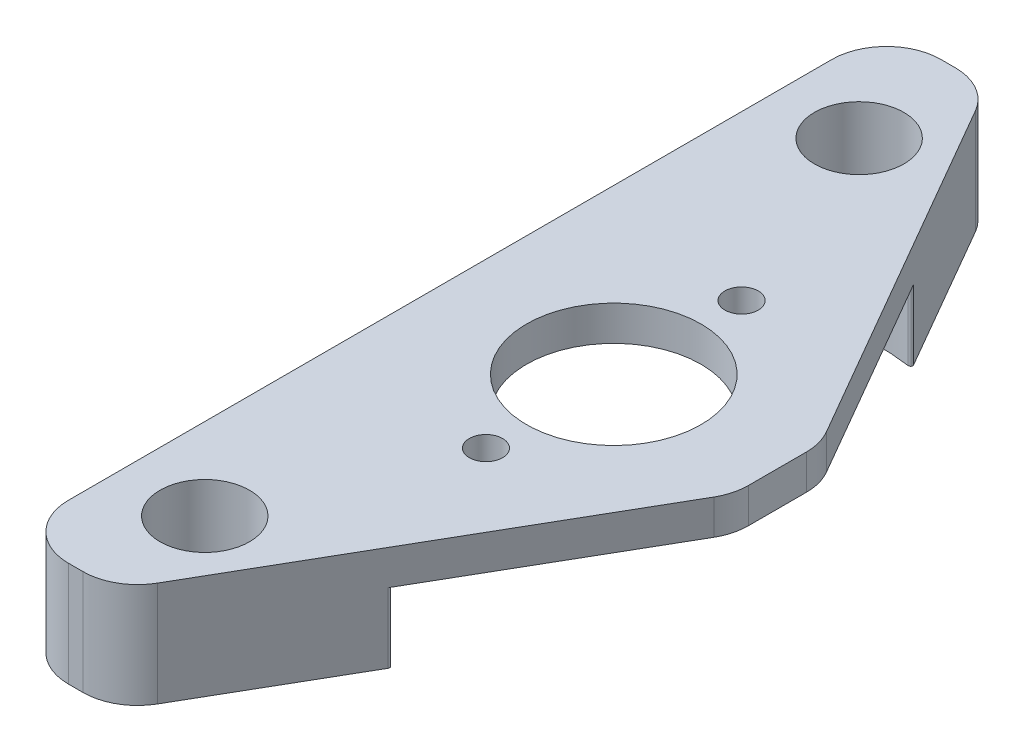
ISO-10303-21;
HEADER;
FILE_DESCRIPTION(('STEP AP214'),'2;1');
FILE_NAME('part.step','',(''),(''),'','','');
FILE_SCHEMA(('AUTOMOTIVE_DESIGN { 1 0 10303 214 1 1 1 1 }'));
ENDSEC;
DATA;
#1=APPLICATION_CONTEXT('core data for automotive mechanical design processes');
#2=APPLICATION_PROTOCOL_DEFINITION('international standard','automotive_design',2000,#1);
#3=PRODUCT_CONTEXT('',#1,'mechanical');
#4=PRODUCT('Part','Part','',(#3));
#5=PRODUCT_RELATED_PRODUCT_CATEGORY('part','',(#4));
#6=PRODUCT_DEFINITION_FORMATION('','',#4);
#7=PRODUCT_DEFINITION_CONTEXT('part definition',#1,'design');
#8=PRODUCT_DEFINITION('design','',#6,#7);
#9=PRODUCT_DEFINITION_SHAPE('','',#8);
#10=(LENGTH_UNIT() NAMED_UNIT(*) SI_UNIT(.MILLI.,.METRE.));
#11=(NAMED_UNIT(*) PLANE_ANGLE_UNIT() SI_UNIT($,.RADIAN.));
#12=(NAMED_UNIT(*) SI_UNIT($,.STERADIAN.) SOLID_ANGLE_UNIT());
#13=UNCERTAINTY_MEASURE_WITH_UNIT(LENGTH_MEASURE(1.E-05),#10,'distance_accuracy_value','');
#14=(GEOMETRIC_REPRESENTATION_CONTEXT(3) GLOBAL_UNCERTAINTY_ASSIGNED_CONTEXT((#13)) GLOBAL_UNIT_ASSIGNED_CONTEXT((#10,
#11,#12)) REPRESENTATION_CONTEXT('',''));
#15=CARTESIAN_POINT('',(0.,0.,0.));
#16=DIRECTION('',(0.,0.,1.));
#17=DIRECTION('',(1.,0.,0.));
#18=AXIS2_PLACEMENT_3D('',#15,#16,#17);
#19=CARTESIAN_POINT('',(0.,4.064,0.));
#20=DIRECTION('',(0.,-1.,0.));
#21=DIRECTION('',(0.,0.,-1.));
#22=AXIS2_PLACEMENT_3D('',#19,#20,#21);
#23=CYLINDRICAL_SURFACE('',#22,15.24);
#24=DIRECTION('',(0.,-1.,0.));
#25=VECTOR('',#24,1.);
#26=CARTESIAN_POINT('',(-9.32033057851238,4.064,12.0577376778253));
#27=LINE('',#26,#25);
#28=CARTESIAN_POINT('',(-9.32033057851238,4.064,12.0577376778253));
#29=VERTEX_POINT('',#28);
#30=CARTESIAN_POINT('',(-9.32033057851238,0.,12.0577376778253));
#31=VERTEX_POINT('',#30);
#32=EDGE_CURVE('E220',#29,#31,#27,.T.);
#33=ORIENTED_EDGE('',*,*,#32,.F.);
#34=CARTESIAN_POINT('',(0.,4.064,0.));
#35=DIRECTION('',(0.,-1.,0.));
#36=DIRECTION('',(0.,0.,-1.));
#37=AXIS2_PLACEMENT_3D('',#34,#35,#36);
#38=CIRCLE('',#37,15.24);
#39=CARTESIAN_POINT('',(2.03518826968259,4.064,15.1034965722162));
#40=VERTEX_POINT('',#39);
#41=EDGE_CURVE('E301',#29,#40,#38,.F.);
#42=ORIENTED_EDGE('',*,*,#41,.T.);
#43=DIRECTION('',(0.,-1.,0.));
#44=VECTOR('',#43,1.);
#45=CARTESIAN_POINT('',(2.03518826968259,4.064,15.1034965722162));
#46=LINE('',#45,#44);
#47=CARTESIAN_POINT('',(2.03518826968259,0.,15.1034965722162));
#48=VERTEX_POINT('',#47);
#49=EDGE_CURVE('E221',#48,#40,#46,.F.);
#50=ORIENTED_EDGE('',*,*,#49,.F.);
#51=CARTESIAN_POINT('',(0.,0.,0.));
#52=DIRECTION('',(0.,-1.,0.));
#53=DIRECTION('',(0.,0.,-1.));
#54=AXIS2_PLACEMENT_3D('',#51,#52,#53);
#55=CIRCLE('',#54,15.24);
#56=EDGE_CURVE('E306',#48,#31,#55,.T.);
#57=ORIENTED_EDGE('',*,*,#56,.T.);
#58=EDGE_LOOP('',(#33,#42,#50,#57));
#59=FACE_BOUND('',#58,.T.);
#60=ADVANCED_FACE('F17',(#59),#23,.F.);
#61=CARTESIAN_POINT('',(0.,4.064,0.));
#62=DIRECTION('',(0.,-1.,0.));
#63=DIRECTION('',(0.,0.,-1.));
#64=AXIS2_PLACEMENT_3D('',#61,#62,#63);
#65=CYLINDRICAL_SURFACE('',#64,15.24);
#66=CARTESIAN_POINT('',(0.,4.064,0.));
#67=DIRECTION('',(0.,-1.,0.));
#68=DIRECTION('',(0.,0.,-1.));
#69=AXIS2_PLACEMENT_3D('',#66,#67,#68);
#70=CIRCLE('',#69,15.24);
#71=CARTESIAN_POINT('',(2.03518826968258,4.064,-15.1034965722162));
#72=VERTEX_POINT('',#71);
#73=CARTESIAN_POINT('',(-9.32033057851238,4.064,-12.0577376778253));
#74=VERTEX_POINT('',#73);
#75=EDGE_CURVE('E64',#72,#74,#70,.F.);
#76=ORIENTED_EDGE('',*,*,#75,.T.);
#77=DIRECTION('',(0.,-1.,0.));
#78=VECTOR('',#77,1.);
#79=CARTESIAN_POINT('',(-9.32033057851238,4.064,-12.0577376778253));
#80=LINE('',#79,#78);
#81=CARTESIAN_POINT('',(-9.32033057851238,0.,-12.0577376778253));
#82=VERTEX_POINT('',#81);
#83=EDGE_CURVE('E179',#82,#74,#80,.F.);
#84=ORIENTED_EDGE('',*,*,#83,.F.);
#85=CARTESIAN_POINT('',(0.,0.,0.));
#86=DIRECTION('',(0.,-1.,0.));
#87=DIRECTION('',(0.,0.,-1.));
#88=AXIS2_PLACEMENT_3D('',#85,#86,#87);
#89=CIRCLE('',#88,15.24);
#90=CARTESIAN_POINT('',(2.03518826968258,0.,-15.1034965722162));
#91=VERTEX_POINT('',#90);
#92=EDGE_CURVE('E283',#82,#91,#89,.T.);
#93=ORIENTED_EDGE('',*,*,#92,.T.);
#94=DIRECTION('',(0.,-1.,0.));
#95=VECTOR('',#94,1.);
#96=CARTESIAN_POINT('',(2.03518826968258,4.064,-15.1034965722162));
#97=LINE('',#96,#95);
#98=EDGE_CURVE('E206',#72,#91,#97,.T.);
#99=ORIENTED_EDGE('',*,*,#98,.F.);
#100=EDGE_LOOP('',(#76,#84,#93,#99));
#101=FACE_BOUND('',#100,.T.);
#102=ADVANCED_FACE('F626',(#101),#65,.F.);
#103=CARTESIAN_POINT('',(2.05214817192994,4.064,-15.2293590436513));
#104=DIRECTION('',(0.,-1.,0.));
#105=DIRECTION('',(0.,0.,-1.));
#106=AXIS2_PLACEMENT_3D('',#103,#104,#105);
#107=CYLINDRICAL_SURFACE('',#106,0.127);
#108=CARTESIAN_POINT('',(2.05214817192994,4.064,-15.2293590436513));
#109=DIRECTION('',(0.,-1.,0.));
#110=DIRECTION('',(0.,0.,-1.));
#111=AXIS2_PLACEMENT_3D('',#108,#109,#110);
#112=CIRCLE('',#111,0.127);
#113=CARTESIAN_POINT('',(2.16213339821056,4.064,-15.2928590436513));
#114=VERTEX_POINT('',#113);
#115=EDGE_CURVE('E292',#114,#72,#112,.T.);
#116=ORIENTED_EDGE('',*,*,#115,.T.);
#117=ORIENTED_EDGE('',*,*,#98,.T.);
#118=CARTESIAN_POINT('',(2.05214817192994,0.,-15.2293590436513));
#119=DIRECTION('',(0.,-1.,0.));
#120=DIRECTION('',(0.,0.,-1.));
#121=AXIS2_PLACEMENT_3D('',#118,#119,#120);
#122=CIRCLE('',#121,0.127);
#123=CARTESIAN_POINT('',(2.16213339821056,0.,-15.2928590436513));
#124=VERTEX_POINT('',#123);
#125=EDGE_CURVE('E289',#91,#124,#122,.F.);
#126=ORIENTED_EDGE('',*,*,#125,.T.);
#127=DIRECTION('',(0.,1.,0.));
#128=VECTOR('',#127,1.);
#129=CARTESIAN_POINT('',(2.16213339821056,-48.4998214151962,-15.2928590436513));
#130=LINE('',#129,#128);
#131=EDGE_CURVE('E210',#124,#114,#130,.T.);
#132=ORIENTED_EDGE('',*,*,#131,.T.);
#133=EDGE_LOOP('',(#116,#117,#126,#132));
#134=FACE_BOUND('',#133,.T.);
#135=ADVANCED_FACE('F414',(#134),#107,.T.);
#136=CARTESIAN_POINT('',(9.52500000000001,6.096,-25.4));
#137=DIRECTION('',(0.,0.,1.));
#138=DIRECTION('',(1.,0.,0.));
#139=AXIS2_PLACEMENT_3D('',#136,#137,#138);
#140=PLANE('',#139);
#141=DIRECTION('',(0.,-1.,0.));
#142=VECTOR('',#141,1.);
#143=CARTESIAN_POINT('',(-5.5063142583519,6.096,-25.4));
#144=LINE('',#143,#142);
#145=CARTESIAN_POINT('',(-5.5063142583519,0.,-25.4));
#146=VERTEX_POINT('',#145);
#147=CARTESIAN_POINT('',(-5.5063142583519,6.096,-25.4));
#148=VERTEX_POINT('',#147);
#149=EDGE_CURVE('E282',#146,#148,#144,.F.);
#150=ORIENTED_EDGE('',*,*,#149,.F.);
#151=DIRECTION('',(1.,0.,0.));
#152=VECTOR('',#151,1.);
#153=CARTESIAN_POINT('',(-9.52499999999999,0.,-25.4));
#154=LINE('',#153,#152);
#155=CARTESIAN_POINT('',(-6.34999999999999,0.,-25.4));
#156=VERTEX_POINT('',#155);
#157=EDGE_CURVE('E288',#146,#156,#154,.F.);
#158=ORIENTED_EDGE('',*,*,#157,.T.);
#159=DIRECTION('',(0.,-1.,0.));
#160=VECTOR('',#159,1.);
#161=CARTESIAN_POINT('',(-6.34999999999999,6.096,-25.4));
#162=LINE('',#161,#160);
#163=CARTESIAN_POINT('',(-6.34999999999999,6.096,-25.4));
#164=VERTEX_POINT('',#163);
#165=EDGE_CURVE('E278',#164,#156,#162,.T.);
#166=ORIENTED_EDGE('',*,*,#165,.F.);
#167=DIRECTION('',(1.,0.,0.));
#168=VECTOR('',#167,1.);
#169=CARTESIAN_POINT('',(9.52500000000001,6.096,-25.4));
#170=LINE('',#169,#168);
#171=EDGE_CURVE('E204',#148,#164,#170,.F.);
#172=ORIENTED_EDGE('',*,*,#171,.F.);
#173=EDGE_LOOP('',(#150,#158,#166,#172));
#174=FACE_BOUND('',#173,.T.);
#175=ADVANCED_FACE('F376',(#174),#140,.F.);
#176=CARTESIAN_POINT('',(-9.39799999999998,4.064,12.1582188251405));
#177=DIRECTION('',(0.,-1.,0.));
#178=DIRECTION('',(0.,0.,-1.));
#179=AXIS2_PLACEMENT_3D('',#176,#177,#178);
#180=CYLINDRICAL_SURFACE('',#179,0.127);
#181=CARTESIAN_POINT('',(-9.39799999999998,0.,12.1582188251405));
#182=DIRECTION('',(0.,-1.,0.));
#183=DIRECTION('',(0.,0.,-1.));
#184=AXIS2_PLACEMENT_3D('',#181,#182,#183);
#185=CIRCLE('',#184,0.127);
#186=CARTESIAN_POINT('',(-9.52499999999999,0.,12.1582188251405));
#187=VERTEX_POINT('',#186);
#188=EDGE_CURVE('E56',#31,#187,#185,.F.);
#189=ORIENTED_EDGE('',*,*,#188,.T.);
#190=DIRECTION('',(0.,1.,0.));
#191=VECTOR('',#190,1.);
#192=CARTESIAN_POINT('',(-9.52499999999999,6.096,12.1582188251405));
#193=LINE('',#192,#191);
#194=CARTESIAN_POINT('',(-9.52499999999999,4.064,12.1582188251405));
#195=VERTEX_POINT('',#194);
#196=EDGE_CURVE('E167',#187,#195,#193,.T.);
#197=ORIENTED_EDGE('',*,*,#196,.T.);
#198=CARTESIAN_POINT('',(-9.39799999999998,4.064,12.1582188251405));
#199=DIRECTION('',(0.,-1.,0.));
#200=DIRECTION('',(0.,0.,-1.));
#201=AXIS2_PLACEMENT_3D('',#198,#199,#200);
#202=CIRCLE('',#201,0.127);
#203=EDGE_CURVE('E181',#195,#29,#202,.T.);
#204=ORIENTED_EDGE('',*,*,#203,.T.);
#205=ORIENTED_EDGE('',*,*,#32,.T.);
#206=EDGE_LOOP('',(#189,#197,#204,#205));
#207=FACE_BOUND('',#206,.T.);
#208=ADVANCED_FACE('F405',(#207),#180,.T.);
#209=CARTESIAN_POINT('',(-9.39799999999998,4.064,-12.1582188251405));
#210=DIRECTION('',(0.,-1.,0.));
#211=DIRECTION('',(0.,0.,-1.));
#212=AXIS2_PLACEMENT_3D('',#209,#210,#211);
#213=CYLINDRICAL_SURFACE('',#212,0.127);
#214=CARTESIAN_POINT('',(-9.39799999999998,0.,-12.1582188251405));
#215=DIRECTION('',(0.,-1.,0.));
#216=DIRECTION('',(0.,0.,-1.));
#217=AXIS2_PLACEMENT_3D('',#214,#215,#216);
#218=CIRCLE('',#217,0.127);
#219=CARTESIAN_POINT('',(-9.52499999999999,0.,-12.1582188251405));
#220=VERTEX_POINT('',#219);
#221=EDGE_CURVE('E286',#220,#82,#218,.F.);
#222=ORIENTED_EDGE('',*,*,#221,.T.);
#223=ORIENTED_EDGE('',*,*,#83,.T.);
#224=CARTESIAN_POINT('',(-9.39799999999998,4.064,-12.1582188251405));
#225=DIRECTION('',(0.,-1.,0.));
#226=DIRECTION('',(0.,0.,-1.));
#227=AXIS2_PLACEMENT_3D('',#224,#225,#226);
#228=CIRCLE('',#227,0.127);
#229=CARTESIAN_POINT('',(-9.52499999999999,4.064,-12.1582188251405));
#230=VERTEX_POINT('',#229);
#231=EDGE_CURVE('E172',#74,#230,#228,.T.);
#232=ORIENTED_EDGE('',*,*,#231,.T.);
#233=DIRECTION('',(0.,1.,0.));
#234=VECTOR('',#233,1.);
#235=CARTESIAN_POINT('',(-9.52499999999999,6.096,-12.1582188251405));
#236=LINE('',#235,#234);
#237=EDGE_CURVE('E177',#230,#220,#236,.F.);
#238=ORIENTED_EDGE('',*,*,#237,.T.);
#239=EDGE_LOOP('',(#222,#223,#232,#238));
#240=FACE_BOUND('',#239,.T.);
#241=ADVANCED_FACE('F175',(#240),#213,.T.);
#242=CARTESIAN_POINT('',(-9.52499999999999,6.096,25.4));
#243=DIRECTION('',(0.,0.,-1.));
#244=DIRECTION('',(-1.,0.,0.));
#245=AXIS2_PLACEMENT_3D('',#242,#243,#244);
#246=PLANE('',#245);
#247=DIRECTION('',(0.,1.,0.));
#248=VECTOR('',#247,1.);
#249=CARTESIAN_POINT('',(-5.50631425835189,6.096,25.4));
#250=LINE('',#249,#248);
#251=CARTESIAN_POINT('',(-5.50631425835189,6.096,25.4));
#252=VERTEX_POINT('',#251);
#253=CARTESIAN_POINT('',(-5.50631425835189,0.,25.4));
#254=VERTEX_POINT('',#253);
#255=EDGE_CURVE('E270',#252,#254,#250,.F.);
#256=ORIENTED_EDGE('',*,*,#255,.F.);
#257=DIRECTION('',(-1.,0.,0.));
#258=VECTOR('',#257,1.);
#259=CARTESIAN_POINT('',(-9.52499999999999,6.096,25.4));
#260=LINE('',#259,#258);
#261=CARTESIAN_POINT('',(-6.34999999999999,6.096,25.4));
#262=VERTEX_POINT('',#261);
#263=EDGE_CURVE('E218',#262,#252,#260,.F.);
#264=ORIENTED_EDGE('',*,*,#263,.F.);
#265=DIRECTION('',(0.,-1.,0.));
#266=VECTOR('',#265,1.);
#267=CARTESIAN_POINT('',(-6.34999999999999,6.096,25.4));
#268=LINE('',#267,#266);
#269=CARTESIAN_POINT('',(-6.34999999999999,0.,25.4));
#270=VERTEX_POINT('',#269);
#271=EDGE_CURVE('E271',#270,#262,#268,.F.);
#272=ORIENTED_EDGE('',*,*,#271,.F.);
#273=DIRECTION('',(1.,0.,0.));
#274=VECTOR('',#273,1.);
#275=CARTESIAN_POINT('',(-9.52499999999999,0.,25.4));
#276=LINE('',#275,#274);
#277=EDGE_CURVE('E310',#270,#254,#276,.T.);
#278=ORIENTED_EDGE('',*,*,#277,.T.);
#279=EDGE_LOOP('',(#256,#264,#272,#278));
#280=FACE_BOUND('',#279,.T.);
#281=ADVANCED_FACE('F388',(#280),#246,.F.);
#282=CARTESIAN_POINT('',(2.05214817192994,4.064,15.2293590436513));
#283=DIRECTION('',(0.,-1.,0.));
#284=DIRECTION('',(0.,0.,-1.));
#285=AXIS2_PLACEMENT_3D('',#282,#283,#284);
#286=CYLINDRICAL_SURFACE('',#285,0.127);
#287=DIRECTION('',(0.,1.,0.));
#288=VECTOR('',#287,1.);
#289=CARTESIAN_POINT('',(2.16213339821056,-48.4998214151962,15.2928590436513));
#290=LINE('',#289,#288);
#291=CARTESIAN_POINT('',(2.16213339821056,4.06400000000002,15.2928590436513));
#292=VERTEX_POINT('',#291);
#293=CARTESIAN_POINT('',(2.16213339821056,0.,15.2928590436513));
#294=VERTEX_POINT('',#293);
#295=EDGE_CURVE('E318',#292,#294,#290,.F.);
#296=ORIENTED_EDGE('',*,*,#295,.T.);
#297=CARTESIAN_POINT('',(2.05214817192994,0.,15.2293590436513));
#298=DIRECTION('',(0.,-1.,0.));
#299=DIRECTION('',(0.,0.,-1.));
#300=AXIS2_PLACEMENT_3D('',#297,#298,#299);
#301=CIRCLE('',#300,0.127);
#302=EDGE_CURVE('E309',#294,#48,#301,.F.);
#303=ORIENTED_EDGE('',*,*,#302,.T.);
#304=ORIENTED_EDGE('',*,*,#49,.T.);
#305=CARTESIAN_POINT('',(2.05214817192994,4.064,15.2293590436513));
#306=DIRECTION('',(0.,-1.,0.));
#307=DIRECTION('',(0.,0.,-1.));
#308=AXIS2_PLACEMENT_3D('',#305,#306,#307);
#309=CIRCLE('',#308,0.127);
#310=EDGE_CURVE('E299',#40,#292,#309,.T.);
#311=ORIENTED_EDGE('',*,*,#310,.T.);
#312=EDGE_LOOP('',(#296,#303,#304,#311));
#313=FACE_BOUND('',#312,.T.);
#314=ADVANCED_FACE('F399',(#313),#286,.T.);
#315=CARTESIAN_POINT('',(6.35000000000001,6.096,-1.68926131403118));
#316=DIRECTION('',(0.,1.,0.));
#317=DIRECTION('',(0.,0.,1.));
#318=AXIS2_PLACEMENT_3D('',#315,#316,#317);
#319=CYLINDRICAL_SURFACE('',#318,3.175);
#320=CARTESIAN_POINT('',(6.35000000000001,6.096,-1.68926131403118));
#321=DIRECTION('',(0.,1.,0.));
#322=DIRECTION('',(0.,0.,1.));
#323=AXIS2_PLACEMENT_3D('',#320,#321,#322);
#324=CIRCLE('',#323,3.175);
#325=CARTESIAN_POINT('',(9.09963065701561,6.096,-3.27676131403118));
#326=VERTEX_POINT('',#325);
#327=CARTESIAN_POINT('',(9.52500000000001,6.096,-1.68926131403118));
#328=VERTEX_POINT('',#327);
#329=EDGE_CURVE('E20',#326,#328,#324,.F.);
#330=ORIENTED_EDGE('',*,*,#329,.T.);
#331=DIRECTION('',(0.,1.,0.));
#332=VECTOR('',#331,1.);
#333=CARTESIAN_POINT('',(9.52500000000001,6.096,-1.68926131403118));
#334=LINE('',#333,#332);
#335=CARTESIAN_POINT('',(9.52500000000001,4.064,-1.68926131403118));
#336=VERTEX_POINT('',#335);
#337=EDGE_CURVE('E323',#328,#336,#334,.F.);
#338=ORIENTED_EDGE('',*,*,#337,.T.);
#339=CARTESIAN_POINT('',(6.35000000000001,4.064,-1.68926131403118));
#340=DIRECTION('',(0.,1.,0.));
#341=DIRECTION('',(0.,0.,1.));
#342=AXIS2_PLACEMENT_3D('',#339,#340,#341);
#343=CIRCLE('',#342,3.175);
#344=CARTESIAN_POINT('',(9.0996306570156,4.064,-3.27676131403118));
#345=VERTEX_POINT('',#344);
#346=EDGE_CURVE('E295',#336,#345,#343,.T.);
#347=ORIENTED_EDGE('',*,*,#346,.T.);
#348=DIRECTION('',(0.,1.,0.));
#349=VECTOR('',#348,1.);
#350=CARTESIAN_POINT('',(9.0996306570156,-48.4998214151962,-3.27676131403118));
#351=LINE('',#350,#349);
#352=EDGE_CURVE('E211',#345,#326,#351,.T.);
#353=ORIENTED_EDGE('',*,*,#352,.T.);
#354=EDGE_LOOP('',(#330,#338,#347,#353));
#355=FACE_BOUND('',#354,.T.);
#356=ADVANCED_FACE('F361',(#355),#319,.T.);
#357=CARTESIAN_POINT('',(6.35000000000001,6.096,1.68926131403118));
#358=DIRECTION('',(0.,-1.,0.));
#359=DIRECTION('',(0.,0.,-1.));
#360=AXIS2_PLACEMENT_3D('',#357,#358,#359);
#361=CYLINDRICAL_SURFACE('',#360,3.175);
#362=CARTESIAN_POINT('',(6.35000000000001,6.096,1.68926131403118));
#363=DIRECTION('',(0.,-1.,0.));
#364=DIRECTION('',(0.,0.,-1.));
#365=AXIS2_PLACEMENT_3D('',#362,#363,#364);
#366=CIRCLE('',#365,3.175);
#367=CARTESIAN_POINT('',(9.52500000000001,6.096,1.68926131403118));
#368=VERTEX_POINT('',#367);
#369=CARTESIAN_POINT('',(9.09963065701561,6.096,3.27676131403118));
#370=VERTEX_POINT('',#369);
#371=EDGE_CURVE('E84',#368,#370,#366,.T.);
#372=ORIENTED_EDGE('',*,*,#371,.T.);
#373=DIRECTION('',(0.,1.,0.));
#374=VECTOR('',#373,1.);
#375=CARTESIAN_POINT('',(9.09963065701561,-48.4998214151962,3.27676131403118));
#376=LINE('',#375,#374);
#377=CARTESIAN_POINT('',(9.09963065701561,4.06400000000001,3.27676131403118));
#378=VERTEX_POINT('',#377);
#379=EDGE_CURVE('E319',#370,#378,#376,.F.);
#380=ORIENTED_EDGE('',*,*,#379,.T.);
#381=CARTESIAN_POINT('',(6.35000000000001,4.064,1.68926131403118));
#382=DIRECTION('',(0.,-1.,0.));
#383=DIRECTION('',(0.,0.,-1.));
#384=AXIS2_PLACEMENT_3D('',#381,#382,#383);
#385=CIRCLE('',#384,3.175);
#386=CARTESIAN_POINT('',(9.52500000000001,4.064,1.68926131403118));
#387=VERTEX_POINT('',#386);
#388=EDGE_CURVE('E297',#378,#387,#385,.F.);
#389=ORIENTED_EDGE('',*,*,#388,.T.);
#390=DIRECTION('',(0.,1.,0.));
#391=VECTOR('',#390,1.);
#392=CARTESIAN_POINT('',(9.52500000000001,6.096,1.68926131403118));
#393=LINE('',#392,#391);
#394=EDGE_CURVE('E267',#387,#368,#393,.T.);
#395=ORIENTED_EDGE('',*,*,#394,.T.);
#396=EDGE_LOOP('',(#372,#380,#389,#395));
#397=FACE_BOUND('',#396,.T.);
#398=ADVANCED_FACE('F396',(#397),#361,.T.);
#399=CARTESIAN_POINT('',(-9.52499999999999,0.,25.4));
#400=DIRECTION('',(0.,1.,0.));
#401=DIRECTION('',(0.,0.,1.));
#402=AXIS2_PLACEMENT_3D('',#399,#400,#401);
#403=PLANE('',#402);
#404=ORIENTED_EDGE('',*,*,#188,.F.);
#405=ORIENTED_EDGE('',*,*,#56,.F.);
#406=ORIENTED_EDGE('',*,*,#302,.F.);
#407=DIRECTION('',(-0.5,0.,0.866025403784439));
#408=VECTOR('',#407,1.);
#409=CARTESIAN_POINT('',(9.52500000000001,0.,2.54));
#410=LINE('',#409,#408);
#411=CARTESIAN_POINT('',(-2.75668360133629,0.,23.8125));
#412=VERTEX_POINT('',#411);
#413=EDGE_CURVE('E320',#294,#412,#410,.T.);
#414=ORIENTED_EDGE('',*,*,#413,.T.);
#415=CARTESIAN_POINT('',(-5.50631425835189,0.,22.225));
#416=DIRECTION('',(0.,1.,0.));
#417=DIRECTION('',(0.,0.,1.));
#418=AXIS2_PLACEMENT_3D('',#415,#416,#417);
#419=CIRCLE('',#418,3.175);
#420=EDGE_CURVE('E268',#254,#412,#419,.T.);
#421=ORIENTED_EDGE('',*,*,#420,.F.);
#422=ORIENTED_EDGE('',*,*,#277,.F.);
#423=CARTESIAN_POINT('',(-6.34999999999999,0.,22.225));
#424=DIRECTION('',(0.,-1.,0.));
#425=DIRECTION('',(0.,0.,-1.));
#426=AXIS2_PLACEMENT_3D('',#423,#424,#425);
#427=CIRCLE('',#426,3.175);
#428=CARTESIAN_POINT('',(-9.52499999999999,0.,22.225));
#429=VERTEX_POINT('',#428);
#430=EDGE_CURVE('E272',#429,#270,#427,.F.);
#431=ORIENTED_EDGE('',*,*,#430,.F.);
#432=DIRECTION('',(0.,0.,-1.));
#433=VECTOR('',#432,1.);
#434=CARTESIAN_POINT('',(-9.52499999999999,0.,-25.4));
#435=LINE('',#434,#433);
#436=EDGE_CURVE('E200',#429,#187,#435,.T.);
#437=ORIENTED_EDGE('',*,*,#436,.T.);
#438=EDGE_LOOP('',(#404,#405,#406,#414,#421,#422,#431,#437));
#439=FACE_BOUND('',#438,.T.);
#440=CARTESIAN_POINT('',(-4.76249999999999,0.,19.05));
#441=DIRECTION('',(0.,1.,0.));
#442=DIRECTION('',(0.,0.,1.));
#443=AXIS2_PLACEMENT_3D('',#440,#441,#442);
#444=CIRCLE('',#443,2.6035);
#445=CARTESIAN_POINT('',(-4.76249999999999,0.,21.6535));
#446=VERTEX_POINT('',#445);
#447=EDGE_CURVE('E264',#446,#446,#444,.T.);
#448=ORIENTED_EDGE('',*,*,#447,.T.);
#449=EDGE_LOOP('',(#448));
#450=FACE_BOUND('',#449,.T.);
#451=ADVANCED_FACE('F401',(#439,#450),#403,.F.);
#452=CARTESIAN_POINT('',(0.,4.064,0.));
#453=DIRECTION('',(0.,1.,0.));
#454=DIRECTION('',(0.,0.,1.));
#455=AXIS2_PLACEMENT_3D('',#452,#453,#454);
#456=PLANE('',#455);
#457=ORIENTED_EDGE('',*,*,#115,.F.);
#458=DIRECTION('',(0.5,0.,0.866025403784439));
#459=VECTOR('',#458,1.);
#460=CARTESIAN_POINT('',(-3.67322715367483,4.064,-25.4));
#461=LINE('',#460,#459);
#462=EDGE_CURVE('E213',#114,#345,#461,.T.);
#463=ORIENTED_EDGE('',*,*,#462,.T.);
#464=ORIENTED_EDGE('',*,*,#346,.F.);
#465=DIRECTION('',(0.,0.,1.));
#466=VECTOR('',#465,1.);
#467=CARTESIAN_POINT('',(9.52500000000001,4.064,25.4));
#468=LINE('',#467,#466);
#469=EDGE_CURVE('E325',#336,#387,#468,.T.);
#470=ORIENTED_EDGE('',*,*,#469,.T.);
#471=ORIENTED_EDGE('',*,*,#388,.F.);
#472=DIRECTION('',(-0.5,0.,0.866025403784439));
#473=VECTOR('',#472,1.);
#474=CARTESIAN_POINT('',(9.52500000000001,4.06400000000003,2.54));
#475=LINE('',#474,#473);
#476=EDGE_CURVE('E315',#378,#292,#475,.T.);
#477=ORIENTED_EDGE('',*,*,#476,.T.);
#478=ORIENTED_EDGE('',*,*,#310,.F.);
#479=ORIENTED_EDGE('',*,*,#41,.F.);
#480=ORIENTED_EDGE('',*,*,#203,.F.);
#481=DIRECTION('',(0.,0.,-1.));
#482=VECTOR('',#481,1.);
#483=CARTESIAN_POINT('',(-9.52499999999999,4.064,-25.4));
#484=LINE('',#483,#482);
#485=EDGE_CURVE('E184',#195,#230,#484,.T.);
#486=ORIENTED_EDGE('',*,*,#485,.T.);
#487=ORIENTED_EDGE('',*,*,#231,.F.);
#488=ORIENTED_EDGE('',*,*,#75,.F.);
#489=EDGE_LOOP('',(#457,#463,#464,#470,#471,#477,#478,#479,#480,#486,#487,#488));
#490=FACE_BOUND('',#489,.T.);
#491=CARTESIAN_POINT('',(0.,4.064,0.));
#492=DIRECTION('',(0.,-1.,0.));
#493=DIRECTION('',(0.,0.,-1.));
#494=AXIS2_PLACEMENT_3D('',#491,#492,#493);
#495=CIRCLE('',#494,5.08);
#496=CARTESIAN_POINT('',(0.,4.064,-5.08));
#497=VERTEX_POINT('',#496);
#498=EDGE_CURVE('E255',#497,#497,#495,.F.);
#499=ORIENTED_EDGE('',*,*,#498,.T.);
#500=EDGE_LOOP('',(#499));
#501=FACE_BOUND('',#500,.T.);
#502=CARTESIAN_POINT('',(0.,4.064,7.4422));
#503=DIRECTION('',(0.,-1.,0.));
#504=DIRECTION('',(0.,0.,-1.));
#505=AXIS2_PLACEMENT_3D('',#502,#503,#504);
#506=CIRCLE('',#505,0.97028);
#507=CARTESIAN_POINT('',(0.,4.064,6.47192));
#508=VERTEX_POINT('',#507);
#509=EDGE_CURVE('E261',#508,#508,#506,.F.);
#510=ORIENTED_EDGE('',*,*,#509,.T.);
#511=EDGE_LOOP('',(#510));
#512=FACE_BOUND('',#511,.T.);
#513=CARTESIAN_POINT('',(0.,4.064,-7.4422));
#514=DIRECTION('',(0.,-1.,0.));
#515=DIRECTION('',(0.,0.,-1.));
#516=AXIS2_PLACEMENT_3D('',#513,#514,#515);
#517=CIRCLE('',#516,0.97028);
#518=CARTESIAN_POINT('',(0.,4.064,-8.41248));
#519=VERTEX_POINT('',#518);
#520=EDGE_CURVE('E258',#519,#519,#517,.F.);
#521=ORIENTED_EDGE('',*,*,#520,.T.);
#522=EDGE_LOOP('',(#521));
#523=FACE_BOUND('',#522,.T.);
#524=ADVANCED_FACE('F186',(#490,#501,#512,#523),#456,.F.);
#525=CARTESIAN_POINT('',(-9.52499999999999,0.,25.4));
#526=DIRECTION('',(0.,1.,0.));
#527=DIRECTION('',(0.,0.,1.));
#528=AXIS2_PLACEMENT_3D('',#525,#526,#527);
#529=PLANE('',#528);
#530=ORIENTED_EDGE('',*,*,#92,.F.);
#531=ORIENTED_EDGE('',*,*,#221,.F.);
#532=DIRECTION('',(0.,0.,-1.));
#533=VECTOR('',#532,1.);
#534=CARTESIAN_POINT('',(-9.52499999999999,0.,-25.4));
#535=LINE('',#534,#533);
#536=CARTESIAN_POINT('',(-9.52499999999999,0.,-22.225));
#537=VERTEX_POINT('',#536);
#538=EDGE_CURVE('E195',#220,#537,#535,.T.);
#539=ORIENTED_EDGE('',*,*,#538,.T.);
#540=CARTESIAN_POINT('',(-6.34999999999999,0.,-22.225));
#541=DIRECTION('',(0.,-1.,0.));
#542=DIRECTION('',(0.,0.,-1.));
#543=AXIS2_PLACEMENT_3D('',#540,#541,#542);
#544=CIRCLE('',#543,3.175);
#545=EDGE_CURVE('E275',#156,#537,#544,.F.);
#546=ORIENTED_EDGE('',*,*,#545,.F.);
#547=ORIENTED_EDGE('',*,*,#157,.F.);
#548=CARTESIAN_POINT('',(-5.5063142583519,0.,-22.225));
#549=DIRECTION('',(0.,-1.,0.));
#550=DIRECTION('',(0.,0.,-1.));
#551=AXIS2_PLACEMENT_3D('',#548,#549,#550);
#552=CIRCLE('',#551,3.175);
#553=CARTESIAN_POINT('',(-2.7566836013363,0.,-23.8125));
#554=VERTEX_POINT('',#553);
#555=EDGE_CURVE('E279',#554,#146,#552,.F.);
#556=ORIENTED_EDGE('',*,*,#555,.F.);
#557=DIRECTION('',(0.5,0.,0.866025403784439));
#558=VECTOR('',#557,1.);
#559=CARTESIAN_POINT('',(-3.67322715367483,0.,-25.4));
#560=LINE('',#559,#558);
#561=EDGE_CURVE('E207',#554,#124,#560,.T.);
#562=ORIENTED_EDGE('',*,*,#561,.T.);
#563=ORIENTED_EDGE('',*,*,#125,.F.);
#564=EDGE_LOOP('',(#530,#531,#539,#546,#547,#556,#562,#563));
#565=FACE_BOUND('',#564,.T.);
#566=CARTESIAN_POINT('',(-4.76249999999999,0.,-19.05));
#567=DIRECTION('',(0.,1.,0.));
#568=DIRECTION('',(0.,0.,1.));
#569=AXIS2_PLACEMENT_3D('',#566,#567,#568);
#570=CIRCLE('',#569,2.6035);
#571=CARTESIAN_POINT('',(-4.76249999999999,0.,-16.4465));
#572=VERTEX_POINT('',#571);
#573=EDGE_CURVE('E252',#572,#572,#570,.T.);
#574=ORIENTED_EDGE('',*,*,#573,.T.);
#575=EDGE_LOOP('',(#574));
#576=FACE_BOUND('',#575,.T.);
#577=ADVANCED_FACE('F459',(#565,#576),#529,.F.);
#578=CARTESIAN_POINT('',(-3.67322715367483,-48.4998214151962,-25.4));
#579=DIRECTION('',(-0.866025403784439,0.,0.5));
#580=DIRECTION('',(0.5,0.,0.866025403784439));
#581=AXIS2_PLACEMENT_3D('',#578,#579,#580);
#582=PLANE('',#581);
#583=ORIENTED_EDGE('',*,*,#131,.F.);
#584=ORIENTED_EDGE('',*,*,#561,.F.);
#585=DIRECTION('',(0.,-1.,0.));
#586=VECTOR('',#585,1.);
#587=CARTESIAN_POINT('',(-2.7566836013363,6.096,-23.8125));
#588=LINE('',#587,#586);
#589=CARTESIAN_POINT('',(-2.7566836013363,6.096,-23.8125));
#590=VERTEX_POINT('',#589);
#591=EDGE_CURVE('E216',#590,#554,#588,.T.);
#592=ORIENTED_EDGE('',*,*,#591,.F.);
#593=DIRECTION('',(-0.5,0.,-0.866025403784439));
#594=VECTOR('',#593,1.);
#595=CARTESIAN_POINT('',(9.09963065701561,6.096,-3.27676131403118));
#596=LINE('',#595,#594);
#597=EDGE_CURVE('E251',#326,#590,#596,.T.);
#598=ORIENTED_EDGE('',*,*,#597,.F.);
#599=ORIENTED_EDGE('',*,*,#352,.F.);
#600=ORIENTED_EDGE('',*,*,#462,.F.);
#601=EDGE_LOOP('',(#583,#584,#592,#598,#599,#600));
#602=FACE_BOUND('',#601,.T.);
#603=ADVANCED_FACE('F368',(#602),#582,.F.);
#604=CARTESIAN_POINT('',(-5.5063142583519,6.096,-22.225));
#605=DIRECTION('',(0.,-1.,0.));
#606=DIRECTION('',(0.,0.,-1.));
#607=AXIS2_PLACEMENT_3D('',#604,#605,#606);
#608=CYLINDRICAL_SURFACE('',#607,3.175);
#609=ORIENTED_EDGE('',*,*,#555,.T.);
#610=ORIENTED_EDGE('',*,*,#149,.T.);
#611=CARTESIAN_POINT('',(-5.5063142583519,6.096,-22.225));
#612=DIRECTION('',(0.,-1.,0.));
#613=DIRECTION('',(0.,0.,-1.));
#614=AXIS2_PLACEMENT_3D('',#611,#612,#613);
#615=CIRCLE('',#614,3.175);
#616=EDGE_CURVE('E248',#590,#148,#615,.F.);
#617=ORIENTED_EDGE('',*,*,#616,.F.);
#618=ORIENTED_EDGE('',*,*,#591,.T.);
#619=EDGE_LOOP('',(#609,#610,#617,#618));
#620=FACE_BOUND('',#619,.T.);
#621=ADVANCED_FACE('F372',(#620),#608,.T.);
#622=CARTESIAN_POINT('',(-6.34999999999999,6.096,-22.225));
#623=DIRECTION('',(0.,-1.,0.));
#624=DIRECTION('',(0.,0.,-1.));
#625=AXIS2_PLACEMENT_3D('',#622,#623,#624);
#626=CYLINDRICAL_SURFACE('',#625,3.175);
#627=ORIENTED_EDGE('',*,*,#545,.T.);
#628=DIRECTION('',(0.,1.,0.));
#629=VECTOR('',#628,1.);
#630=CARTESIAN_POINT('',(-9.52499999999999,6.096,-22.225));
#631=LINE('',#630,#629);
#632=CARTESIAN_POINT('',(-9.52499999999999,6.096,-22.225));
#633=VERTEX_POINT('',#632);
#634=EDGE_CURVE('E277',#537,#633,#631,.T.);
#635=ORIENTED_EDGE('',*,*,#634,.T.);
#636=CARTESIAN_POINT('',(-6.34999999999999,6.096,-22.225));
#637=DIRECTION('',(0.,-1.,0.));
#638=DIRECTION('',(0.,0.,-1.));
#639=AXIS2_PLACEMENT_3D('',#636,#637,#638);
#640=CIRCLE('',#639,3.175);
#641=EDGE_CURVE('E245',#164,#633,#640,.F.);
#642=ORIENTED_EDGE('',*,*,#641,.F.);
#643=ORIENTED_EDGE('',*,*,#165,.T.);
#644=EDGE_LOOP('',(#627,#635,#642,#643));
#645=FACE_BOUND('',#644,.T.);
#646=ADVANCED_FACE('F380',(#645),#626,.T.);
#647=CARTESIAN_POINT('',(-9.52499999999999,6.096,-25.4));
#648=DIRECTION('',(1.,0.,0.));
#649=DIRECTION('',(0.,0.,-1.));
#650=AXIS2_PLACEMENT_3D('',#647,#648,#649);
#651=PLANE('',#650);
#652=ORIENTED_EDGE('',*,*,#237,.F.);
#653=ORIENTED_EDGE('',*,*,#485,.F.);
#654=ORIENTED_EDGE('',*,*,#196,.F.);
#655=ORIENTED_EDGE('',*,*,#436,.F.);
#656=DIRECTION('',(0.,-1.,0.));
#657=VECTOR('',#656,1.);
#658=CARTESIAN_POINT('',(-9.52499999999999,6.096,22.225));
#659=LINE('',#658,#657);
#660=CARTESIAN_POINT('',(-9.52499999999999,6.096,22.225));
#661=VERTEX_POINT('',#660);
#662=EDGE_CURVE('E197',#661,#429,#659,.T.);
#663=ORIENTED_EDGE('',*,*,#662,.F.);
#664=DIRECTION('',(0.,0.,1.));
#665=VECTOR('',#664,1.);
#666=CARTESIAN_POINT('',(-9.52499999999999,6.096,25.4));
#667=LINE('',#666,#665);
#668=EDGE_CURVE('E244',#633,#661,#667,.T.);
#669=ORIENTED_EDGE('',*,*,#668,.F.);
#670=ORIENTED_EDGE('',*,*,#634,.F.);
#671=ORIENTED_EDGE('',*,*,#538,.F.);
#672=EDGE_LOOP('',(#652,#653,#654,#655,#663,#669,#670,#671));
#673=FACE_BOUND('',#672,.T.);
#674=ADVANCED_FACE('F192',(#673),#651,.F.);
#675=CARTESIAN_POINT('',(-6.34999999999999,6.096,22.225));
#676=DIRECTION('',(0.,-1.,0.));
#677=DIRECTION('',(0.,0.,-1.));
#678=AXIS2_PLACEMENT_3D('',#675,#676,#677);
#679=CYLINDRICAL_SURFACE('',#678,3.175);
#680=ORIENTED_EDGE('',*,*,#430,.T.);
#681=ORIENTED_EDGE('',*,*,#271,.T.);
#682=CARTESIAN_POINT('',(-6.34999999999999,6.096,22.225));
#683=DIRECTION('',(0.,-1.,0.));
#684=DIRECTION('',(0.,0.,-1.));
#685=AXIS2_PLACEMENT_3D('',#682,#683,#684);
#686=CIRCLE('',#685,3.175);
#687=EDGE_CURVE('E241',#661,#262,#686,.F.);
#688=ORIENTED_EDGE('',*,*,#687,.F.);
#689=ORIENTED_EDGE('',*,*,#662,.T.);
#690=EDGE_LOOP('',(#680,#681,#688,#689));
#691=FACE_BOUND('',#690,.T.);
#692=ADVANCED_FACE('F385',(#691),#679,.T.);
#693=CARTESIAN_POINT('',(-5.50631425835189,6.096,22.225));
#694=DIRECTION('',(0.,1.,0.));
#695=DIRECTION('',(0.,0.,1.));
#696=AXIS2_PLACEMENT_3D('',#693,#694,#695);
#697=CYLINDRICAL_SURFACE('',#696,3.175);
#698=CARTESIAN_POINT('',(-5.50631425835189,6.096,22.225));
#699=DIRECTION('',(0.,1.,0.));
#700=DIRECTION('',(0.,0.,1.));
#701=AXIS2_PLACEMENT_3D('',#698,#699,#700);
#702=CIRCLE('',#701,3.175);
#703=CARTESIAN_POINT('',(-2.7566836013363,6.096,23.8125));
#704=VERTEX_POINT('',#703);
#705=EDGE_CURVE('E237',#252,#704,#702,.T.);
#706=ORIENTED_EDGE('',*,*,#705,.F.);
#707=ORIENTED_EDGE('',*,*,#255,.T.);
#708=ORIENTED_EDGE('',*,*,#420,.T.);
#709=DIRECTION('',(0.,1.,0.));
#710=VECTOR('',#709,1.);
#711=CARTESIAN_POINT('',(-2.7566836013363,-48.4998214151962,23.8125));
#712=LINE('',#711,#710);
#713=EDGE_CURVE('E93',#412,#704,#712,.T.);
#714=ORIENTED_EDGE('',*,*,#713,.T.);
#715=EDGE_LOOP('',(#706,#707,#708,#714));
#716=FACE_BOUND('',#715,.T.);
#717=ADVANCED_FACE('F390',(#716),#697,.T.);
#718=CARTESIAN_POINT('',(9.52500000000001,-48.4998214151962,2.54));
#719=DIRECTION('',(-0.866025403784439,0.,-0.5));
#720=DIRECTION('',(-0.5,0.,0.866025403784439));
#721=AXIS2_PLACEMENT_3D('',#718,#719,#720);
#722=PLANE('',#721);
#723=ORIENTED_EDGE('',*,*,#295,.F.);
#724=ORIENTED_EDGE('',*,*,#476,.F.);
#725=ORIENTED_EDGE('',*,*,#379,.F.);
#726=DIRECTION('',(0.5,0.,-0.866025403784439));
#727=VECTOR('',#726,1.);
#728=CARTESIAN_POINT('',(-2.7566836013363,6.096,23.8125));
#729=LINE('',#728,#727);
#730=EDGE_CURVE('E240',#704,#370,#729,.T.);
#731=ORIENTED_EDGE('',*,*,#730,.F.);
#732=ORIENTED_EDGE('',*,*,#713,.F.);
#733=ORIENTED_EDGE('',*,*,#413,.F.);
#734=EDGE_LOOP('',(#723,#724,#725,#731,#732,#733));
#735=FACE_BOUND('',#734,.T.);
#736=ADVANCED_FACE('F393',(#735),#722,.F.);
#737=CARTESIAN_POINT('',(9.52500000000001,6.096,25.4));
#738=DIRECTION('',(-1.,0.,0.));
#739=DIRECTION('',(0.,0.,1.));
#740=AXIS2_PLACEMENT_3D('',#737,#738,#739);
#741=PLANE('',#740);
#742=ORIENTED_EDGE('',*,*,#469,.F.);
#743=ORIENTED_EDGE('',*,*,#337,.F.);
#744=DIRECTION('',(0.,0.,1.));
#745=VECTOR('',#744,1.);
#746=CARTESIAN_POINT('',(9.52500000000001,6.096,25.4));
#747=LINE('',#746,#745);
#748=EDGE_CURVE('E236',#368,#328,#747,.F.);
#749=ORIENTED_EDGE('',*,*,#748,.F.);
#750=ORIENTED_EDGE('',*,*,#394,.F.);
#751=EDGE_LOOP('',(#742,#743,#749,#750));
#752=FACE_BOUND('',#751,.T.);
#753=ADVANCED_FACE('F359',(#752),#741,.F.);
#754=CARTESIAN_POINT('',(-4.76249999999999,-48.4998214151962,19.05));
#755=DIRECTION('',(0.,1.,0.));
#756=DIRECTION('',(0.,0.,1.));
#757=AXIS2_PLACEMENT_3D('',#754,#755,#756);
#758=CYLINDRICAL_SURFACE('',#757,2.6035);
#759=ORIENTED_EDGE('',*,*,#447,.F.);
#760=EDGE_LOOP('',(#759));
#761=FACE_BOUND('',#760,.T.);
#762=CARTESIAN_POINT('',(-4.76249999999999,6.096,19.05));
#763=DIRECTION('',(0.,1.,0.));
#764=DIRECTION('',(0.,0.,1.));
#765=AXIS2_PLACEMENT_3D('',#762,#763,#764);
#766=CIRCLE('',#765,2.6035);
#767=CARTESIAN_POINT('',(-4.76249999999999,6.096,21.6535));
#768=VERTEX_POINT('',#767);
#769=EDGE_CURVE('E233',#768,#768,#766,.F.);
#770=ORIENTED_EDGE('',*,*,#769,.F.);
#771=EDGE_LOOP('',(#770));
#772=FACE_BOUND('',#771,.T.);
#773=ADVANCED_FACE('F438',(#761,#772),#758,.F.);
#774=CARTESIAN_POINT('',(0.,6.096,7.4422));
#775=DIRECTION('',(0.,-1.,0.));
#776=DIRECTION('',(0.,0.,-1.));
#777=AXIS2_PLACEMENT_3D('',#774,#775,#776);
#778=CYLINDRICAL_SURFACE('',#777,0.97028);
#779=ORIENTED_EDGE('',*,*,#509,.F.);
#780=EDGE_LOOP('',(#779));
#781=FACE_BOUND('',#780,.T.);
#782=CARTESIAN_POINT('',(0.,6.096,7.4422));
#783=DIRECTION('',(0.,-1.,0.));
#784=DIRECTION('',(0.,0.,-1.));
#785=AXIS2_PLACEMENT_3D('',#782,#783,#784);
#786=CIRCLE('',#785,0.97028);
#787=CARTESIAN_POINT('',(0.,6.096,6.47192));
#788=VERTEX_POINT('',#787);
#789=EDGE_CURVE('E230',#788,#788,#786,.T.);
#790=ORIENTED_EDGE('',*,*,#789,.F.);
#791=EDGE_LOOP('',(#790));
#792=FACE_BOUND('',#791,.T.);
#793=ADVANCED_FACE('F434',(#781,#792),#778,.F.);
#794=CARTESIAN_POINT('',(0.,6.096,-7.4422));
#795=DIRECTION('',(0.,-1.,0.));
#796=DIRECTION('',(0.,0.,-1.));
#797=AXIS2_PLACEMENT_3D('',#794,#795,#796);
#798=CYLINDRICAL_SURFACE('',#797,0.97028);
#799=ORIENTED_EDGE('',*,*,#520,.F.);
#800=EDGE_LOOP('',(#799));
#801=FACE_BOUND('',#800,.T.);
#802=CARTESIAN_POINT('',(0.,6.096,-7.4422));
#803=DIRECTION('',(0.,-1.,0.));
#804=DIRECTION('',(0.,0.,-1.));
#805=AXIS2_PLACEMENT_3D('',#802,#803,#804);
#806=CIRCLE('',#805,0.97028);
#807=CARTESIAN_POINT('',(0.,6.096,-8.41248));
#808=VERTEX_POINT('',#807);
#809=EDGE_CURVE('E227',#808,#808,#806,.T.);
#810=ORIENTED_EDGE('',*,*,#809,.F.);
#811=EDGE_LOOP('',(#810));
#812=FACE_BOUND('',#811,.T.);
#813=ADVANCED_FACE('F430',(#801,#812),#798,.F.);
#814=CARTESIAN_POINT('',(0.,54.5958214151962,0.));
#815=DIRECTION('',(0.,-1.,0.));
#816=DIRECTION('',(0.,0.,-1.));
#817=AXIS2_PLACEMENT_3D('',#814,#815,#816);
#818=CYLINDRICAL_SURFACE('',#817,5.08);
#819=ORIENTED_EDGE('',*,*,#498,.F.);
#820=EDGE_LOOP('',(#819));
#821=FACE_BOUND('',#820,.T.);
#822=CARTESIAN_POINT('',(0.,6.096,0.));
#823=DIRECTION('',(0.,-1.,0.));
#824=DIRECTION('',(0.,0.,-1.));
#825=AXIS2_PLACEMENT_3D('',#822,#823,#824);
#826=CIRCLE('',#825,5.08);
#827=CARTESIAN_POINT('',(0.,6.096,-5.08));
#828=VERTEX_POINT('',#827);
#829=EDGE_CURVE('E26',#828,#828,#826,.T.);
#830=ORIENTED_EDGE('',*,*,#829,.F.);
#831=EDGE_LOOP('',(#830));
#832=FACE_BOUND('',#831,.T.);
#833=ADVANCED_FACE('F423',(#821,#832),#818,.F.);
#834=CARTESIAN_POINT('',(-4.76249999999999,-48.4998214151962,-19.05));
#835=DIRECTION('',(0.,1.,0.));
#836=DIRECTION('',(0.,0.,1.));
#837=AXIS2_PLACEMENT_3D('',#834,#835,#836);
#838=CYLINDRICAL_SURFACE('',#837,2.6035);
#839=ORIENTED_EDGE('',*,*,#573,.F.);
#840=EDGE_LOOP('',(#839));
#841=FACE_BOUND('',#840,.T.);
#842=CARTESIAN_POINT('',(-4.76249999999999,6.096,-19.05));
#843=DIRECTION('',(0.,1.,0.));
#844=DIRECTION('',(0.,0.,1.));
#845=AXIS2_PLACEMENT_3D('',#842,#843,#844);
#846=CIRCLE('',#845,2.6035);
#847=CARTESIAN_POINT('',(-4.76249999999999,6.096,-16.4465));
#848=VERTEX_POINT('',#847);
#849=EDGE_CURVE('E11',#848,#848,#846,.F.);
#850=ORIENTED_EDGE('',*,*,#849,.F.);
#851=EDGE_LOOP('',(#850));
#852=FACE_BOUND('',#851,.T.);
#853=ADVANCED_FACE('F417',(#841,#852),#838,.F.);
#854=CARTESIAN_POINT('',(-9.52499999999999,6.096,25.4));
#855=DIRECTION('',(0.,1.,0.));
#856=DIRECTION('',(0.,0.,1.));
#857=AXIS2_PLACEMENT_3D('',#854,#855,#856);
#858=PLANE('',#857);
#859=ORIENTED_EDGE('',*,*,#849,.T.);
#860=EDGE_LOOP('',(#859));
#861=FACE_BOUND('',#860,.T.);
#862=ORIENTED_EDGE('',*,*,#829,.T.);
#863=EDGE_LOOP('',(#862));
#864=FACE_BOUND('',#863,.T.);
#865=ORIENTED_EDGE('',*,*,#809,.T.);
#866=EDGE_LOOP('',(#865));
#867=FACE_BOUND('',#866,.T.);
#868=ORIENTED_EDGE('',*,*,#789,.T.);
#869=EDGE_LOOP('',(#868));
#870=FACE_BOUND('',#869,.T.);
#871=ORIENTED_EDGE('',*,*,#769,.T.);
#872=EDGE_LOOP('',(#871));
#873=FACE_BOUND('',#872,.T.);
#874=ORIENTED_EDGE('',*,*,#748,.T.);
#875=ORIENTED_EDGE('',*,*,#329,.F.);
#876=ORIENTED_EDGE('',*,*,#597,.T.);
#877=ORIENTED_EDGE('',*,*,#616,.T.);
#878=ORIENTED_EDGE('',*,*,#171,.T.);
#879=ORIENTED_EDGE('',*,*,#641,.T.);
#880=ORIENTED_EDGE('',*,*,#668,.T.);
#881=ORIENTED_EDGE('',*,*,#687,.T.);
#882=ORIENTED_EDGE('',*,*,#263,.T.);
#883=ORIENTED_EDGE('',*,*,#705,.T.);
#884=ORIENTED_EDGE('',*,*,#730,.T.);
#885=ORIENTED_EDGE('',*,*,#371,.F.);
#886=EDGE_LOOP('',(#874,#875,#876,#877,#878,#879,#880,#881,#882,#883,#884,#885));
#887=FACE_BOUND('',#886,.T.);
#888=ADVANCED_FACE('F355',(#861,#864,#867,#870,#873,#887),#858,.T.);
#889=CLOSED_SHELL('',(#60,#102,#135,#175,#208,#241,#281,#314,#356,#398,#451,#524,#577,#603,#621,
#646,#674,#692,#717,#736,#753,#773,#793,#813,#833,#853,#888));
#890=MANIFOLD_SOLID_BREP('B1',#889);
#891=ADVANCED_BREP_SHAPE_REPRESENTATION('',(#18,#890),#14);
#892=SHAPE_DEFINITION_REPRESENTATION(#9,#891);
ENDSEC;
END-ISO-10303-21;
